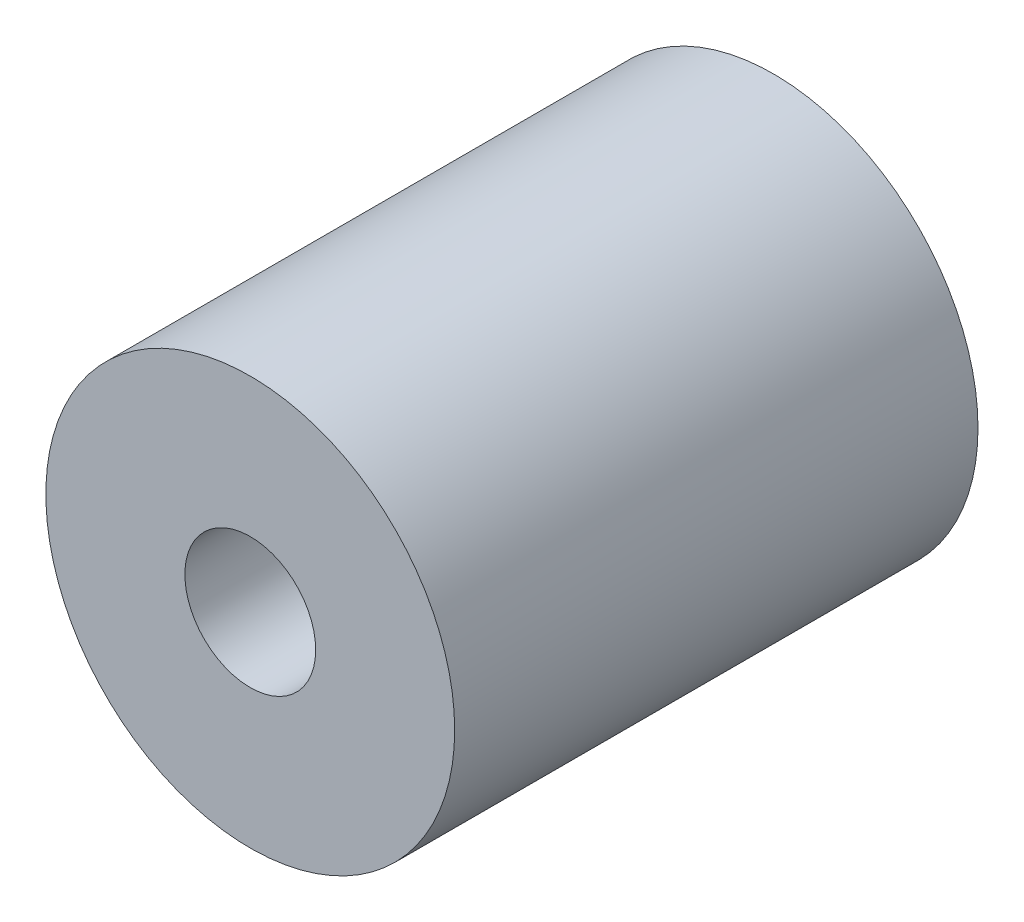
ISO-10303-21;
HEADER;
FILE_DESCRIPTION(('STEP AP214'),'2;1');
FILE_NAME('part.step','',(''),(''),'','','');
FILE_SCHEMA(('AUTOMOTIVE_DESIGN { 1 0 10303 214 1 1 1 1 }'));
ENDSEC;
DATA;
#1=APPLICATION_CONTEXT('core data for automotive mechanical design processes');
#2=APPLICATION_PROTOCOL_DEFINITION('international standard','automotive_design',2000,#1);
#3=PRODUCT_CONTEXT('',#1,'mechanical');
#4=PRODUCT('Part','Part','',(#3));
#5=PRODUCT_RELATED_PRODUCT_CATEGORY('part','',(#4));
#6=PRODUCT_DEFINITION_FORMATION('','',#4);
#7=PRODUCT_DEFINITION_CONTEXT('part definition',#1,'design');
#8=PRODUCT_DEFINITION('design','',#6,#7);
#9=PRODUCT_DEFINITION_SHAPE('','',#8);
#10=(LENGTH_UNIT() NAMED_UNIT(*) SI_UNIT(.MILLI.,.METRE.));
#11=(NAMED_UNIT(*) PLANE_ANGLE_UNIT() SI_UNIT($,.RADIAN.));
#12=(NAMED_UNIT(*) SI_UNIT($,.STERADIAN.) SOLID_ANGLE_UNIT());
#13=UNCERTAINTY_MEASURE_WITH_UNIT(LENGTH_MEASURE(1.E-05),#10,'distance_accuracy_value','');
#14=(GEOMETRIC_REPRESENTATION_CONTEXT(3) GLOBAL_UNCERTAINTY_ASSIGNED_CONTEXT((#13)) GLOBAL_UNIT_ASSIGNED_CONTEXT((#10,
#11,#12)) REPRESENTATION_CONTEXT('',''));
#15=CARTESIAN_POINT('',(0.,0.,0.));
#16=DIRECTION('',(0.,0.,1.));
#17=DIRECTION('',(1.,0.,0.));
#18=AXIS2_PLACEMENT_3D('',#15,#16,#17);
#19=CARTESIAN_POINT('',(0.,0.,32.));
#20=DIRECTION('',(0.,0.,1.));
#21=DIRECTION('',(1.,0.,0.));
#22=AXIS2_PLACEMENT_3D('',#19,#20,#21);
#23=PLANE('',#22);
#24=CARTESIAN_POINT('',(0.,0.,32.));
#25=DIRECTION('',(0.,0.,1.));
#26=DIRECTION('',(1.,0.,0.));
#27=AXIS2_PLACEMENT_3D('',#24,#25,#26);
#28=CIRCLE('',#27,12.5);
#29=CARTESIAN_POINT('',(12.5,0.,32.));
#30=VERTEX_POINT('',#29);
#31=EDGE_CURVE('E10',#30,#30,#28,.T.);
#32=ORIENTED_EDGE('',*,*,#31,.T.);
#33=EDGE_LOOP('',(#32));
#34=FACE_BOUND('',#33,.T.);
#35=CARTESIAN_POINT('',(0.,0.,32.));
#36=DIRECTION('',(0.,0.,1.));
#37=DIRECTION('',(1.,0.,0.));
#38=AXIS2_PLACEMENT_3D('',#35,#36,#37);
#39=CIRCLE('',#38,4.);
#40=CARTESIAN_POINT('',(4.,0.,32.));
#41=VERTEX_POINT('',#40);
#42=EDGE_CURVE('E40',#41,#41,#39,.T.);
#43=ORIENTED_EDGE('',*,*,#42,.F.);
#44=EDGE_LOOP('',(#43));
#45=FACE_BOUND('',#44,.T.);
#46=ADVANCED_FACE('F29',(#34,#45),#23,.T.);
#47=CARTESIAN_POINT('',(0.,0.,0.));
#48=DIRECTION('',(0.,0.,1.));
#49=DIRECTION('',(1.,0.,0.));
#50=AXIS2_PLACEMENT_3D('',#47,#48,#49);
#51=PLANE('',#50);
#52=CARTESIAN_POINT('',(0.,0.,0.));
#53=DIRECTION('',(0.,0.,1.));
#54=DIRECTION('',(1.,0.,0.));
#55=AXIS2_PLACEMENT_3D('',#52,#53,#54);
#56=CIRCLE('',#55,12.5);
#57=CARTESIAN_POINT('',(12.5,0.,0.));
#58=VERTEX_POINT('',#57);
#59=EDGE_CURVE('E36',#58,#58,#56,.T.);
#60=ORIENTED_EDGE('',*,*,#59,.F.);
#61=EDGE_LOOP('',(#60));
#62=FACE_BOUND('',#61,.T.);
#63=CARTESIAN_POINT('',(0.,0.,0.));
#64=DIRECTION('',(0.,0.,1.));
#65=DIRECTION('',(1.,0.,0.));
#66=AXIS2_PLACEMENT_3D('',#63,#64,#65);
#67=CIRCLE('',#66,4.);
#68=CARTESIAN_POINT('',(4.,0.,0.));
#69=VERTEX_POINT('',#68);
#70=EDGE_CURVE('E44',#69,#69,#67,.T.);
#71=ORIENTED_EDGE('',*,*,#70,.T.);
#72=EDGE_LOOP('',(#71));
#73=FACE_BOUND('',#72,.T.);
#74=ADVANCED_FACE('F50',(#62,#73),#51,.F.);
#75=CARTESIAN_POINT('',(0.,0.,32.));
#76=DIRECTION('',(0.,0.,-1.));
#77=DIRECTION('',(-1.,0.,0.));
#78=AXIS2_PLACEMENT_3D('',#75,#76,#77);
#79=CYLINDRICAL_SURFACE('',#78,12.5);
#80=ORIENTED_EDGE('',*,*,#31,.F.);
#81=EDGE_LOOP('',(#80));
#82=FACE_BOUND('',#81,.T.);
#83=ORIENTED_EDGE('',*,*,#59,.T.);
#84=EDGE_LOOP('',(#83));
#85=FACE_BOUND('',#84,.T.);
#86=ADVANCED_FACE('F31',(#82,#85),#79,.T.);
#87=CARTESIAN_POINT('',(0.,0.,32.));
#88=DIRECTION('',(0.,0.,-1.));
#89=DIRECTION('',(-1.,0.,0.));
#90=AXIS2_PLACEMENT_3D('',#87,#88,#89);
#91=CYLINDRICAL_SURFACE('',#90,4.);
#92=ORIENTED_EDGE('',*,*,#42,.T.);
#93=EDGE_LOOP('',(#92));
#94=FACE_BOUND('',#93,.T.);
#95=ORIENTED_EDGE('',*,*,#70,.F.);
#96=EDGE_LOOP('',(#95));
#97=FACE_BOUND('',#96,.T.);
#98=ADVANCED_FACE('F52',(#94,#97),#91,.F.);
#99=CLOSED_SHELL('',(#46,#74,#86,#98));
#100=MANIFOLD_SOLID_BREP('B2',#99);
#101=ADVANCED_BREP_SHAPE_REPRESENTATION('',(#18,#100),#14);
#102=SHAPE_DEFINITION_REPRESENTATION(#9,#101);
ENDSEC;
END-ISO-10303-21;
